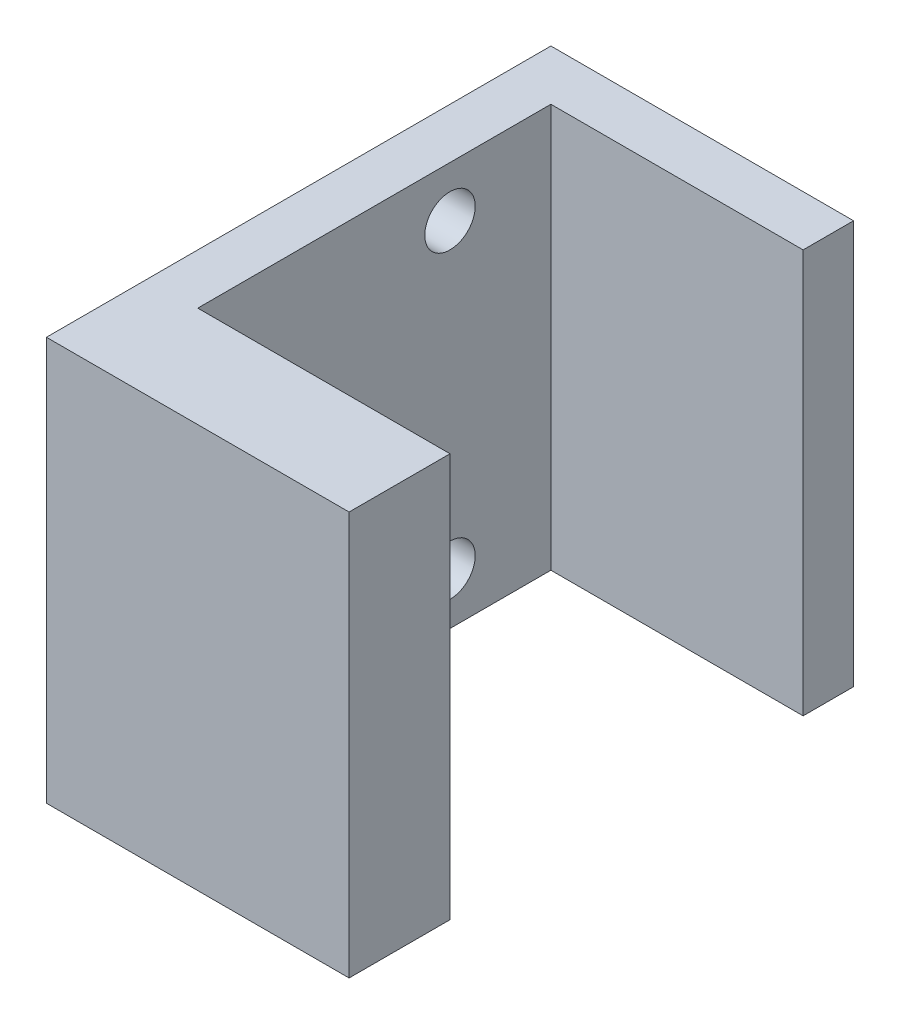
ISO-10303-21;
HEADER;
FILE_DESCRIPTION(('STEP AP214'),'2;1');
FILE_NAME('part.step','',(''),(''),'','','');
FILE_SCHEMA(('AUTOMOTIVE_DESIGN { 1 0 10303 214 1 1 1 1 }'));
ENDSEC;
DATA;
#1=APPLICATION_CONTEXT('core data for automotive mechanical design processes');
#2=APPLICATION_PROTOCOL_DEFINITION('international standard','automotive_design',2000,#1);
#3=PRODUCT_CONTEXT('',#1,'mechanical');
#4=PRODUCT('Part','Part','',(#3));
#5=PRODUCT_RELATED_PRODUCT_CATEGORY('part','',(#4));
#6=PRODUCT_DEFINITION_FORMATION('','',#4);
#7=PRODUCT_DEFINITION_CONTEXT('part definition',#1,'design');
#8=PRODUCT_DEFINITION('design','',#6,#7);
#9=PRODUCT_DEFINITION_SHAPE('','',#8);
#10=(LENGTH_UNIT() NAMED_UNIT(*) SI_UNIT(.MILLI.,.METRE.));
#11=(NAMED_UNIT(*) PLANE_ANGLE_UNIT() SI_UNIT($,.RADIAN.));
#12=(NAMED_UNIT(*) SI_UNIT($,.STERADIAN.) SOLID_ANGLE_UNIT());
#13=UNCERTAINTY_MEASURE_WITH_UNIT(LENGTH_MEASURE(1.E-05),#10,'distance_accuracy_value','');
#14=(GEOMETRIC_REPRESENTATION_CONTEXT(3) GLOBAL_UNCERTAINTY_ASSIGNED_CONTEXT((#13)) GLOBAL_UNIT_ASSIGNED_CONTEXT((#10,
#11,#12)) REPRESENTATION_CONTEXT('',''));
#15=CARTESIAN_POINT('',(0.,0.,0.));
#16=DIRECTION('',(0.,0.,1.));
#17=DIRECTION('',(1.,0.,0.));
#18=AXIS2_PLACEMENT_3D('',#15,#16,#17);
#19=CARTESIAN_POINT('',(-150.,200.,0.));
#20=DIRECTION('',(1.,0.,0.));
#21=DIRECTION('',(0.,0.,-1.));
#22=AXIS2_PLACEMENT_3D('',#19,#20,#21);
#23=PLANE('',#22);
#24=CARTESIAN_POINT('',(-150.,175.,-175.));
#25=DIRECTION('',(-1.,0.,0.));
#26=DIRECTION('',(0.,0.,1.));
#27=AXIS2_PLACEMENT_3D('',#24,#25,#26);
#28=CIRCLE('',#27,12.5);
#29=CARTESIAN_POINT('',(-150.,175.,-162.5));
#30=VERTEX_POINT('',#29);
#31=EDGE_CURVE('E185',#30,#30,#28,.T.);
#32=ORIENTED_EDGE('',*,*,#31,.F.);
#33=EDGE_LOOP('',(#32));
#34=FACE_BOUND('',#33,.T.);
#35=DIRECTION('',(0.,0.,1.));
#36=VECTOR('',#35,1.);
#37=CARTESIAN_POINT('',(-150.,0.,0.));
#38=LINE('',#37,#36);
#39=CARTESIAN_POINT('',(-150.,0.,-250.));
#40=VERTEX_POINT('',#39);
#41=CARTESIAN_POINT('',(-150.,0.,0.));
#42=VERTEX_POINT('',#41);
#43=EDGE_CURVE('E78',#40,#42,#38,.T.);
#44=ORIENTED_EDGE('',*,*,#43,.T.);
#45=DIRECTION('',(0.,-1.,0.));
#46=VECTOR('',#45,1.);
#47=CARTESIAN_POINT('',(-150.,200.,0.));
#48=LINE('',#47,#46);
#49=CARTESIAN_POINT('',(-150.,200.,0.));
#50=VERTEX_POINT('',#49);
#51=EDGE_CURVE('E121',#50,#42,#48,.T.);
#52=ORIENTED_EDGE('',*,*,#51,.F.);
#53=DIRECTION('',(0.,0.,1.));
#54=VECTOR('',#53,1.);
#55=CARTESIAN_POINT('',(-150.,200.,0.));
#56=LINE('',#55,#54);
#57=CARTESIAN_POINT('',(-150.,200.,-250.));
#58=VERTEX_POINT('',#57);
#59=EDGE_CURVE('E109',#58,#50,#56,.T.);
#60=ORIENTED_EDGE('',*,*,#59,.F.);
#61=DIRECTION('',(0.,-1.,0.));
#62=VECTOR('',#61,1.);
#63=CARTESIAN_POINT('',(-150.,200.,-250.));
#64=LINE('',#63,#62);
#65=EDGE_CURVE('E116',#58,#40,#64,.T.);
#66=ORIENTED_EDGE('',*,*,#65,.T.);
#67=EDGE_LOOP('',(#44,#52,#60,#66));
#68=FACE_BOUND('',#67,.T.);
#69=CARTESIAN_POINT('',(-150.,25.,-175.));
#70=DIRECTION('',(-1.,0.,0.));
#71=DIRECTION('',(0.,0.,1.));
#72=AXIS2_PLACEMENT_3D('',#69,#70,#71);
#73=CIRCLE('',#72,12.5);
#74=CARTESIAN_POINT('',(-150.,25.,-162.5));
#75=VERTEX_POINT('',#74);
#76=EDGE_CURVE('E179',#75,#75,#73,.T.);
#77=ORIENTED_EDGE('',*,*,#76,.F.);
#78=EDGE_LOOP('',(#77));
#79=FACE_BOUND('',#78,.T.);
#80=ADVANCED_FACE('F32',(#34,#68,#79),#23,.F.);
#81=CARTESIAN_POINT('',(0.,200.,0.));
#82=DIRECTION('',(-1.,0.,0.));
#83=DIRECTION('',(0.,0.,1.));
#84=AXIS2_PLACEMENT_3D('',#81,#82,#83);
#85=PLANE('',#84);
#86=DIRECTION('',(0.,0.,-1.));
#87=VECTOR('',#86,1.);
#88=CARTESIAN_POINT('',(0.,0.,0.));
#89=LINE('',#88,#87);
#90=CARTESIAN_POINT('',(0.,0.,0.));
#91=VERTEX_POINT('',#90);
#92=CARTESIAN_POINT('',(0.,0.,-50.));
#93=VERTEX_POINT('',#92);
#94=EDGE_CURVE('E129',#91,#93,#89,.T.);
#95=ORIENTED_EDGE('',*,*,#94,.T.);
#96=DIRECTION('',(0.,-1.,0.));
#97=VECTOR('',#96,1.);
#98=CARTESIAN_POINT('',(0.,200.,-50.));
#99=LINE('',#98,#97);
#100=CARTESIAN_POINT('',(0.,200.,-50.));
#101=VERTEX_POINT('',#100);
#102=EDGE_CURVE('E11',#101,#93,#99,.T.);
#103=ORIENTED_EDGE('',*,*,#102,.F.);
#104=DIRECTION('',(0.,0.,-1.));
#105=VECTOR('',#104,1.);
#106=CARTESIAN_POINT('',(0.,200.,0.));
#107=LINE('',#106,#105);
#108=CARTESIAN_POINT('',(0.,200.,0.));
#109=VERTEX_POINT('',#108);
#110=EDGE_CURVE('E144',#109,#101,#107,.T.);
#111=ORIENTED_EDGE('',*,*,#110,.F.);
#112=DIRECTION('',(0.,-1.,0.));
#113=VECTOR('',#112,1.);
#114=CARTESIAN_POINT('',(0.,200.,0.));
#115=LINE('',#114,#113);
#116=EDGE_CURVE('E125',#109,#91,#115,.T.);
#117=ORIENTED_EDGE('',*,*,#116,.T.);
#118=EDGE_LOOP('',(#95,#103,#111,#117));
#119=FACE_BOUND('',#118,.T.);
#120=ADVANCED_FACE('F34',(#119),#85,.F.);
#121=CARTESIAN_POINT('',(0.,200.,-50.));
#122=DIRECTION('',(0.,0.,1.));
#123=DIRECTION('',(1.,0.,0.));
#124=AXIS2_PLACEMENT_3D('',#121,#122,#123);
#125=PLANE('',#124);
#126=DIRECTION('',(-1.,0.,0.));
#127=VECTOR('',#126,1.);
#128=CARTESIAN_POINT('',(0.,0.,-50.));
#129=LINE('',#128,#127);
#130=CARTESIAN_POINT('',(-125.,0.,-50.));
#131=VERTEX_POINT('',#130);
#132=EDGE_CURVE('E132',#93,#131,#129,.T.);
#133=ORIENTED_EDGE('',*,*,#132,.T.);
#134=DIRECTION('',(0.,-1.,0.));
#135=VECTOR('',#134,1.);
#136=CARTESIAN_POINT('',(-125.,200.,-50.));
#137=LINE('',#136,#135);
#138=CARTESIAN_POINT('',(-125.,200.,-50.));
#139=VERTEX_POINT('',#138);
#140=EDGE_CURVE('E41',#139,#131,#137,.T.);
#141=ORIENTED_EDGE('',*,*,#140,.F.);
#142=DIRECTION('',(-1.,0.,0.));
#143=VECTOR('',#142,1.);
#144=CARTESIAN_POINT('',(0.,200.,-50.));
#145=LINE('',#144,#143);
#146=EDGE_CURVE('E92',#101,#139,#145,.T.);
#147=ORIENTED_EDGE('',*,*,#146,.F.);
#148=ORIENTED_EDGE('',*,*,#102,.T.);
#149=EDGE_LOOP('',(#133,#141,#147,#148));
#150=FACE_BOUND('',#149,.T.);
#151=ADVANCED_FACE('F197',(#150),#125,.F.);
#152=CARTESIAN_POINT('',(-125.,200.,-50.));
#153=DIRECTION('',(-1.,0.,0.));
#154=DIRECTION('',(0.,0.,1.));
#155=AXIS2_PLACEMENT_3D('',#152,#153,#154);
#156=PLANE('',#155);
#157=CARTESIAN_POINT('',(-125.,175.,-175.));
#158=DIRECTION('',(-1.,0.,0.));
#159=DIRECTION('',(0.,0.,1.));
#160=AXIS2_PLACEMENT_3D('',#157,#158,#159);
#161=CIRCLE('',#160,12.5);
#162=CARTESIAN_POINT('',(-125.,175.,-162.5));
#163=VERTEX_POINT('',#162);
#164=EDGE_CURVE('E182',#163,#163,#161,.T.);
#165=ORIENTED_EDGE('',*,*,#164,.T.);
#166=EDGE_LOOP('',(#165));
#167=FACE_BOUND('',#166,.T.);
#168=CARTESIAN_POINT('',(-125.,25.,-175.));
#169=DIRECTION('',(-1.,0.,0.));
#170=DIRECTION('',(0.,0.,1.));
#171=AXIS2_PLACEMENT_3D('',#168,#169,#170);
#172=CIRCLE('',#171,12.5);
#173=CARTESIAN_POINT('',(-125.,25.,-162.5));
#174=VERTEX_POINT('',#173);
#175=EDGE_CURVE('E133',#174,#174,#172,.T.);
#176=ORIENTED_EDGE('',*,*,#175,.T.);
#177=EDGE_LOOP('',(#176));
#178=FACE_BOUND('',#177,.T.);
#179=DIRECTION('',(0.,0.,-1.));
#180=VECTOR('',#179,1.);
#181=CARTESIAN_POINT('',(-125.,0.,-50.));
#182=LINE('',#181,#180);
#183=CARTESIAN_POINT('',(-125.,0.,-225.));
#184=VERTEX_POINT('',#183);
#185=EDGE_CURVE('E135',#131,#184,#182,.T.);
#186=ORIENTED_EDGE('',*,*,#185,.T.);
#187=DIRECTION('',(0.,-1.,0.));
#188=VECTOR('',#187,1.);
#189=CARTESIAN_POINT('',(-125.,200.,-225.));
#190=LINE('',#189,#188);
#191=CARTESIAN_POINT('',(-125.,200.,-225.));
#192=VERTEX_POINT('',#191);
#193=EDGE_CURVE('E151',#192,#184,#190,.T.);
#194=ORIENTED_EDGE('',*,*,#193,.F.);
#195=DIRECTION('',(0.,0.,-1.));
#196=VECTOR('',#195,1.);
#197=CARTESIAN_POINT('',(-125.,200.,-50.));
#198=LINE('',#197,#196);
#199=EDGE_CURVE('E159',#139,#192,#198,.T.);
#200=ORIENTED_EDGE('',*,*,#199,.F.);
#201=ORIENTED_EDGE('',*,*,#140,.T.);
#202=EDGE_LOOP('',(#186,#194,#200,#201));
#203=FACE_BOUND('',#202,.T.);
#204=ADVANCED_FACE('F157',(#167,#178,#203),#156,.F.);
#205=CARTESIAN_POINT('',(0.,200.,-225.));
#206=DIRECTION('',(0.,0.,-1.));
#207=DIRECTION('',(-1.,0.,0.));
#208=AXIS2_PLACEMENT_3D('',#205,#206,#207);
#209=PLANE('',#208);
#210=DIRECTION('',(1.,0.,0.));
#211=VECTOR('',#210,1.);
#212=CARTESIAN_POINT('',(0.,0.,-225.));
#213=LINE('',#212,#211);
#214=CARTESIAN_POINT('',(0.,0.,-225.));
#215=VERTEX_POINT('',#214);
#216=EDGE_CURVE('E137',#184,#215,#213,.T.);
#217=ORIENTED_EDGE('',*,*,#216,.T.);
#218=DIRECTION('',(0.,-1.,0.));
#219=VECTOR('',#218,1.);
#220=CARTESIAN_POINT('',(0.,200.,-225.));
#221=LINE('',#220,#219);
#222=CARTESIAN_POINT('',(0.,200.,-225.));
#223=VERTEX_POINT('',#222);
#224=EDGE_CURVE('E148',#223,#215,#221,.T.);
#225=ORIENTED_EDGE('',*,*,#224,.F.);
#226=DIRECTION('',(1.,0.,0.));
#227=VECTOR('',#226,1.);
#228=CARTESIAN_POINT('',(0.,200.,-225.));
#229=LINE('',#228,#227);
#230=EDGE_CURVE('E171',#192,#223,#229,.T.);
#231=ORIENTED_EDGE('',*,*,#230,.F.);
#232=ORIENTED_EDGE('',*,*,#193,.T.);
#233=EDGE_LOOP('',(#217,#225,#231,#232));
#234=FACE_BOUND('',#233,.T.);
#235=ADVANCED_FACE('F167',(#234),#209,.F.);
#236=CARTESIAN_POINT('',(0.,200.,-225.));
#237=DIRECTION('',(-1.,0.,0.));
#238=DIRECTION('',(0.,0.,1.));
#239=AXIS2_PLACEMENT_3D('',#236,#237,#238);
#240=PLANE('',#239);
#241=DIRECTION('',(0.,0.,-1.));
#242=VECTOR('',#241,1.);
#243=CARTESIAN_POINT('',(0.,0.,-225.));
#244=LINE('',#243,#242);
#245=CARTESIAN_POINT('',(0.,0.,-250.));
#246=VERTEX_POINT('',#245);
#247=EDGE_CURVE('E139',#215,#246,#244,.T.);
#248=ORIENTED_EDGE('',*,*,#247,.T.);
#249=DIRECTION('',(0.,-1.,0.));
#250=VECTOR('',#249,1.);
#251=CARTESIAN_POINT('',(0.,200.,-250.));
#252=LINE('',#251,#250);
#253=CARTESIAN_POINT('',(0.,200.,-250.));
#254=VERTEX_POINT('',#253);
#255=EDGE_CURVE('E120',#254,#246,#252,.T.);
#256=ORIENTED_EDGE('',*,*,#255,.F.);
#257=DIRECTION('',(0.,0.,-1.));
#258=VECTOR('',#257,1.);
#259=CARTESIAN_POINT('',(0.,200.,-225.));
#260=LINE('',#259,#258);
#261=EDGE_CURVE('E111',#223,#254,#260,.T.);
#262=ORIENTED_EDGE('',*,*,#261,.F.);
#263=ORIENTED_EDGE('',*,*,#224,.T.);
#264=EDGE_LOOP('',(#248,#256,#262,#263));
#265=FACE_BOUND('',#264,.T.);
#266=ADVANCED_FACE('F170',(#265),#240,.F.);
#267=CARTESIAN_POINT('',(0.,200.,-250.));
#268=DIRECTION('',(0.,0.,1.));
#269=DIRECTION('',(1.,0.,0.));
#270=AXIS2_PLACEMENT_3D('',#267,#268,#269);
#271=PLANE('',#270);
#272=DIRECTION('',(-1.,0.,0.));
#273=VECTOR('',#272,1.);
#274=CARTESIAN_POINT('',(0.,0.,-250.));
#275=LINE('',#274,#273);
#276=EDGE_CURVE('E119',#246,#40,#275,.T.);
#277=ORIENTED_EDGE('',*,*,#276,.T.);
#278=ORIENTED_EDGE('',*,*,#65,.F.);
#279=DIRECTION('',(-1.,0.,0.));
#280=VECTOR('',#279,1.);
#281=CARTESIAN_POINT('',(0.,200.,-250.));
#282=LINE('',#281,#280);
#283=EDGE_CURVE('E105',#254,#58,#282,.T.);
#284=ORIENTED_EDGE('',*,*,#283,.F.);
#285=ORIENTED_EDGE('',*,*,#255,.T.);
#286=EDGE_LOOP('',(#277,#278,#284,#285));
#287=FACE_BOUND('',#286,.T.);
#288=ADVANCED_FACE('F117',(#287),#271,.F.);
#289=CARTESIAN_POINT('',(0.,200.,0.));
#290=DIRECTION('',(0.,0.,-1.));
#291=DIRECTION('',(-1.,0.,0.));
#292=AXIS2_PLACEMENT_3D('',#289,#290,#291);
#293=PLANE('',#292);
#294=DIRECTION('',(1.,0.,0.));
#295=VECTOR('',#294,1.);
#296=CARTESIAN_POINT('',(0.,0.,0.));
#297=LINE('',#296,#295);
#298=EDGE_CURVE('E84',#42,#91,#297,.T.);
#299=ORIENTED_EDGE('',*,*,#298,.T.);
#300=ORIENTED_EDGE('',*,*,#116,.F.);
#301=DIRECTION('',(1.,0.,0.));
#302=VECTOR('',#301,1.);
#303=CARTESIAN_POINT('',(0.,200.,0.));
#304=LINE('',#303,#302);
#305=EDGE_CURVE('E49',#50,#109,#304,.T.);
#306=ORIENTED_EDGE('',*,*,#305,.F.);
#307=ORIENTED_EDGE('',*,*,#51,.T.);
#308=EDGE_LOOP('',(#299,#300,#306,#307));
#309=FACE_BOUND('',#308,.T.);
#310=ADVANCED_FACE('F201',(#309),#293,.F.);
#311=CARTESIAN_POINT('',(0.,200.,0.));
#312=DIRECTION('',(0.,1.,0.));
#313=DIRECTION('',(0.,0.,1.));
#314=AXIS2_PLACEMENT_3D('',#311,#312,#313);
#315=PLANE('',#314);
#316=ORIENTED_EDGE('',*,*,#110,.T.);
#317=ORIENTED_EDGE('',*,*,#146,.T.);
#318=ORIENTED_EDGE('',*,*,#199,.T.);
#319=ORIENTED_EDGE('',*,*,#230,.T.);
#320=ORIENTED_EDGE('',*,*,#261,.T.);
#321=ORIENTED_EDGE('',*,*,#283,.T.);
#322=ORIENTED_EDGE('',*,*,#59,.T.);
#323=ORIENTED_EDGE('',*,*,#305,.T.);
#324=EDGE_LOOP('',(#316,#317,#318,#319,#320,#321,#322,#323));
#325=FACE_BOUND('',#324,.T.);
#326=ADVANCED_FACE('F107',(#325),#315,.T.);
#327=CARTESIAN_POINT('',(0.,0.,0.));
#328=DIRECTION('',(0.,1.,0.));
#329=DIRECTION('',(0.,0.,1.));
#330=AXIS2_PLACEMENT_3D('',#327,#328,#329);
#331=PLANE('',#330);
#332=ORIENTED_EDGE('',*,*,#94,.F.);
#333=ORIENTED_EDGE('',*,*,#298,.F.);
#334=ORIENTED_EDGE('',*,*,#43,.F.);
#335=ORIENTED_EDGE('',*,*,#276,.F.);
#336=ORIENTED_EDGE('',*,*,#247,.F.);
#337=ORIENTED_EDGE('',*,*,#216,.F.);
#338=ORIENTED_EDGE('',*,*,#185,.F.);
#339=ORIENTED_EDGE('',*,*,#132,.F.);
#340=EDGE_LOOP('',(#332,#333,#334,#335,#336,#337,#338,#339));
#341=FACE_BOUND('',#340,.T.);
#342=ADVANCED_FACE('F163',(#341),#331,.F.);
#343=CARTESIAN_POINT('',(-150.,25.,-175.));
#344=DIRECTION('',(-1.,0.,0.));
#345=DIRECTION('',(0.,0.,1.));
#346=AXIS2_PLACEMENT_3D('',#343,#344,#345);
#347=CYLINDRICAL_SURFACE('',#346,12.5);
#348=ORIENTED_EDGE('',*,*,#76,.T.);
#349=EDGE_LOOP('',(#348));
#350=FACE_BOUND('',#349,.T.);
#351=ORIENTED_EDGE('',*,*,#175,.F.);
#352=EDGE_LOOP('',(#351));
#353=FACE_BOUND('',#352,.T.);
#354=ADVANCED_FACE('F224',(#350,#353),#347,.F.);
#355=CARTESIAN_POINT('',(-150.,175.,-175.));
#356=DIRECTION('',(-1.,0.,0.));
#357=DIRECTION('',(0.,0.,1.));
#358=AXIS2_PLACEMENT_3D('',#355,#356,#357);
#359=CYLINDRICAL_SURFACE('',#358,12.5);
#360=ORIENTED_EDGE('',*,*,#31,.T.);
#361=EDGE_LOOP('',(#360));
#362=FACE_BOUND('',#361,.T.);
#363=ORIENTED_EDGE('',*,*,#164,.F.);
#364=EDGE_LOOP('',(#363));
#365=FACE_BOUND('',#364,.T.);
#366=ADVANCED_FACE('F189',(#362,#365),#359,.F.);
#367=CLOSED_SHELL('',(#80,#120,#151,#204,#235,#266,#288,#310,#326,#342,#354,#366));
#368=MANIFOLD_SOLID_BREP('B2',#367);
#369=ADVANCED_BREP_SHAPE_REPRESENTATION('',(#18,#368),#14);
#370=SHAPE_DEFINITION_REPRESENTATION(#9,#369);
ENDSEC;
END-ISO-10303-21;
